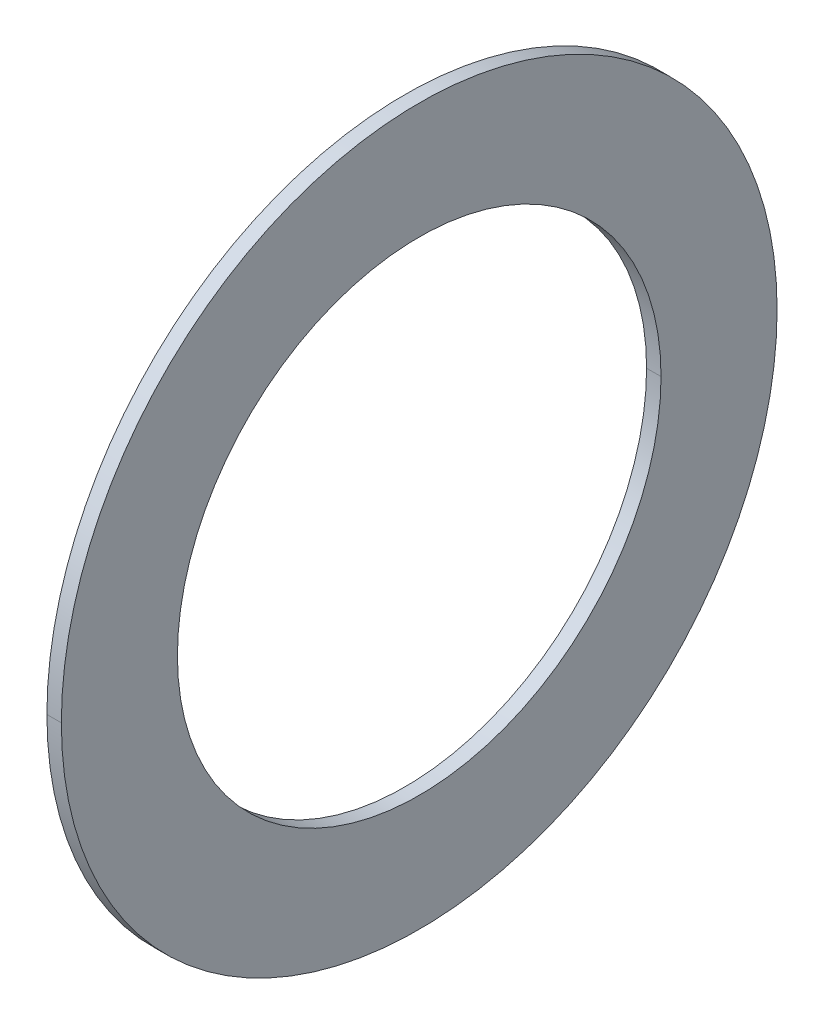
ISO-10303-21;
HEADER;
FILE_DESCRIPTION(('STEP AP214'),'2;1');
FILE_NAME('part.step','',(''),(''),'','','');
FILE_SCHEMA(('AUTOMOTIVE_DESIGN { 1 0 10303 214 1 1 1 1 }'));
ENDSEC;
DATA;
#1=APPLICATION_CONTEXT('core data for automotive mechanical design processes');
#2=APPLICATION_PROTOCOL_DEFINITION('international standard','automotive_design',2000,#1);
#3=PRODUCT_CONTEXT('',#1,'mechanical');
#4=PRODUCT('Part','Part','',(#3));
#5=PRODUCT_RELATED_PRODUCT_CATEGORY('part','',(#4));
#6=PRODUCT_DEFINITION_FORMATION('','',#4);
#7=PRODUCT_DEFINITION_CONTEXT('part definition',#1,'design');
#8=PRODUCT_DEFINITION('design','',#6,#7);
#9=PRODUCT_DEFINITION_SHAPE('','',#8);
#10=(LENGTH_UNIT() NAMED_UNIT(*) SI_UNIT(.MILLI.,.METRE.));
#11=(NAMED_UNIT(*) PLANE_ANGLE_UNIT() SI_UNIT($,.RADIAN.));
#12=(NAMED_UNIT(*) SI_UNIT($,.STERADIAN.) SOLID_ANGLE_UNIT());
#13=UNCERTAINTY_MEASURE_WITH_UNIT(LENGTH_MEASURE(1.E-05),#10,'distance_accuracy_value','');
#14=(GEOMETRIC_REPRESENTATION_CONTEXT(3) GLOBAL_UNCERTAINTY_ASSIGNED_CONTEXT((#13)) GLOBAL_UNIT_ASSIGNED_CONTEXT((#10,
#11,#12)) REPRESENTATION_CONTEXT('',''));
#15=CARTESIAN_POINT('',(0.,0.,0.));
#16=DIRECTION('',(0.,0.,1.));
#17=DIRECTION('',(1.,0.,0.));
#18=AXIS2_PLACEMENT_3D('',#15,#16,#17);
#19=CARTESIAN_POINT('',(0.1992,3.7,0.));
#20=DIRECTION('',(-1.,0.,0.));
#21=DIRECTION('',(0.,0.,1.));
#22=AXIS2_PLACEMENT_3D('',#19,#20,#21);
#23=PLANE('',#22);
#24=CARTESIAN_POINT('',(0.1992,0.,0.));
#25=DIRECTION('',(1.,0.,0.));
#26=DIRECTION('',(0.,0.,-1.));
#27=AXIS2_PLACEMENT_3D('',#24,#25,#26);
#28=CIRCLE('',#27,2.5);
#29=CARTESIAN_POINT('',(0.1992,0.,-2.5));
#30=VERTEX_POINT('',#29);
#31=CARTESIAN_POINT('',(0.1992,0.,2.5));
#32=VERTEX_POINT('',#31);
#33=EDGE_CURVE('E11',#30,#32,#28,.T.);
#34=ORIENTED_EDGE('',*,*,#33,.T.);
#35=CARTESIAN_POINT('',(0.1992,0.,0.));
#36=DIRECTION('',(1.,0.,0.));
#37=DIRECTION('',(0.,0.,-1.));
#38=AXIS2_PLACEMENT_3D('',#35,#36,#37);
#39=CIRCLE('',#38,2.5);
#40=EDGE_CURVE('E25',#32,#30,#39,.T.);
#41=ORIENTED_EDGE('',*,*,#40,.T.);
#42=EDGE_LOOP('',(#34,#41));
#43=FACE_BOUND('',#42,.T.);
#44=CARTESIAN_POINT('',(0.1992,0.,0.));
#45=DIRECTION('',(1.,0.,0.));
#46=DIRECTION('',(0.,0.,-1.));
#47=AXIS2_PLACEMENT_3D('',#44,#45,#46);
#48=CIRCLE('',#47,3.7);
#49=CARTESIAN_POINT('',(0.1992,0.,3.7));
#50=VERTEX_POINT('',#49);
#51=CARTESIAN_POINT('',(0.1992,0.,-3.7));
#52=VERTEX_POINT('',#51);
#53=EDGE_CURVE('E95',#50,#52,#48,.T.);
#54=ORIENTED_EDGE('',*,*,#53,.F.);
#55=CARTESIAN_POINT('',(0.1992,0.,0.));
#56=DIRECTION('',(1.,0.,0.));
#57=DIRECTION('',(0.,0.,-1.));
#58=AXIS2_PLACEMENT_3D('',#55,#56,#57);
#59=CIRCLE('',#58,3.7);
#60=EDGE_CURVE('E90',#52,#50,#59,.T.);
#61=ORIENTED_EDGE('',*,*,#60,.F.);
#62=EDGE_LOOP('',(#54,#61));
#63=FACE_BOUND('',#62,.T.);
#64=ADVANCED_FACE('F17',(#43,#63),#23,.T.);
#65=CARTESIAN_POINT('',(0.3486,0.,0.));
#66=DIRECTION('',(1.,0.,0.));
#67=DIRECTION('',(0.,-1.,0.));
#68=AXIS2_PLACEMENT_3D('',#65,#66,#67);
#69=CYLINDRICAL_SURFACE('',#68,3.7);
#70=DIRECTION('',(1.,0.,0.));
#71=VECTOR('',#70,1.);
#72=CARTESIAN_POINT('',(0.1992,0.,3.7));
#73=LINE('',#72,#71);
#74=CARTESIAN_POINT('',(0.3486,0.,3.7));
#75=VERTEX_POINT('',#74);
#76=EDGE_CURVE('E86',#50,#75,#73,.T.);
#77=ORIENTED_EDGE('',*,*,#76,.T.);
#78=CARTESIAN_POINT('',(0.3486,0.,0.));
#79=DIRECTION('',(1.,0.,0.));
#80=DIRECTION('',(0.,0.,-1.));
#81=AXIS2_PLACEMENT_3D('',#78,#79,#80);
#82=CIRCLE('',#81,3.7);
#83=CARTESIAN_POINT('',(0.3486,0.,-3.7));
#84=VERTEX_POINT('',#83);
#85=EDGE_CURVE('E81',#84,#75,#82,.T.);
#86=ORIENTED_EDGE('',*,*,#85,.F.);
#87=DIRECTION('',(1.,0.,0.));
#88=VECTOR('',#87,1.);
#89=CARTESIAN_POINT('',(0.1992,0.,-3.7));
#90=LINE('',#89,#88);
#91=EDGE_CURVE('E70',#52,#84,#90,.T.);
#92=ORIENTED_EDGE('',*,*,#91,.F.);
#93=ORIENTED_EDGE('',*,*,#60,.T.);
#94=EDGE_LOOP('',(#77,#86,#92,#93));
#95=FACE_BOUND('',#94,.T.);
#96=ADVANCED_FACE('F111',(#95),#69,.T.);
#97=CARTESIAN_POINT('',(0.3486,0.,0.));
#98=DIRECTION('',(1.,0.,0.));
#99=DIRECTION('',(0.,1.,0.));
#100=AXIS2_PLACEMENT_3D('',#97,#98,#99);
#101=CYLINDRICAL_SURFACE('',#100,3.7);
#102=ORIENTED_EDGE('',*,*,#76,.F.);
#103=ORIENTED_EDGE('',*,*,#53,.T.);
#104=ORIENTED_EDGE('',*,*,#91,.T.);
#105=CARTESIAN_POINT('',(0.3486,0.,0.));
#106=DIRECTION('',(1.,0.,0.));
#107=DIRECTION('',(0.,0.,-1.));
#108=AXIS2_PLACEMENT_3D('',#105,#106,#107);
#109=CIRCLE('',#108,3.7);
#110=EDGE_CURVE('E67',#75,#84,#109,.T.);
#111=ORIENTED_EDGE('',*,*,#110,.F.);
#112=EDGE_LOOP('',(#102,#103,#104,#111));
#113=FACE_BOUND('',#112,.T.);
#114=ADVANCED_FACE('F106',(#113),#101,.T.);
#115=CARTESIAN_POINT('',(0.3486,2.5,0.));
#116=DIRECTION('',(1.,0.,0.));
#117=DIRECTION('',(0.,0.,-1.));
#118=AXIS2_PLACEMENT_3D('',#115,#116,#117);
#119=PLANE('',#118);
#120=ORIENTED_EDGE('',*,*,#85,.T.);
#121=ORIENTED_EDGE('',*,*,#110,.T.);
#122=EDGE_LOOP('',(#120,#121));
#123=FACE_BOUND('',#122,.T.);
#124=CARTESIAN_POINT('',(0.3486,0.,0.));
#125=DIRECTION('',(1.,0.,0.));
#126=DIRECTION('',(0.,0.,-1.));
#127=AXIS2_PLACEMENT_3D('',#124,#125,#126);
#128=CIRCLE('',#127,2.5);
#129=CARTESIAN_POINT('',(0.3486,0.,2.5));
#130=VERTEX_POINT('',#129);
#131=CARTESIAN_POINT('',(0.3486,0.,-2.5));
#132=VERTEX_POINT('',#131);
#133=EDGE_CURVE('E55',#130,#132,#128,.T.);
#134=ORIENTED_EDGE('',*,*,#133,.F.);
#135=CARTESIAN_POINT('',(0.3486,0.,0.));
#136=DIRECTION('',(1.,0.,0.));
#137=DIRECTION('',(0.,0.,-1.));
#138=AXIS2_PLACEMENT_3D('',#135,#136,#137);
#139=CIRCLE('',#138,2.5);
#140=EDGE_CURVE('E51',#132,#130,#139,.T.);
#141=ORIENTED_EDGE('',*,*,#140,.F.);
#142=EDGE_LOOP('',(#134,#141));
#143=FACE_BOUND('',#142,.T.);
#144=ADVANCED_FACE('F53',(#123,#143),#119,.T.);
#145=CARTESIAN_POINT('',(0.3486,0.,0.));
#146=DIRECTION('',(1.,0.,0.));
#147=DIRECTION('',(0.,-1.,0.));
#148=AXIS2_PLACEMENT_3D('',#145,#146,#147);
#149=CYLINDRICAL_SURFACE('',#148,2.5);
#150=DIRECTION('',(1.,0.,0.));
#151=VECTOR('',#150,1.);
#152=CARTESIAN_POINT('',(0.1992,0.,2.5));
#153=LINE('',#152,#151);
#154=EDGE_CURVE('E59',#32,#130,#153,.T.);
#155=ORIENTED_EDGE('',*,*,#154,.F.);
#156=ORIENTED_EDGE('',*,*,#33,.F.);
#157=DIRECTION('',(1.,0.,0.));
#158=VECTOR('',#157,1.);
#159=CARTESIAN_POINT('',(0.1992,0.,-2.5));
#160=LINE('',#159,#158);
#161=EDGE_CURVE('E62',#30,#132,#160,.T.);
#162=ORIENTED_EDGE('',*,*,#161,.T.);
#163=ORIENTED_EDGE('',*,*,#140,.T.);
#164=EDGE_LOOP('',(#155,#156,#162,#163));
#165=FACE_BOUND('',#164,.T.);
#166=ADVANCED_FACE('F63',(#165),#149,.F.);
#167=CARTESIAN_POINT('',(0.3486,0.,0.));
#168=DIRECTION('',(1.,0.,0.));
#169=DIRECTION('',(0.,1.,0.));
#170=AXIS2_PLACEMENT_3D('',#167,#168,#169);
#171=CYLINDRICAL_SURFACE('',#170,2.5);
#172=ORIENTED_EDGE('',*,*,#154,.T.);
#173=ORIENTED_EDGE('',*,*,#133,.T.);
#174=ORIENTED_EDGE('',*,*,#161,.F.);
#175=ORIENTED_EDGE('',*,*,#40,.F.);
#176=EDGE_LOOP('',(#172,#173,#174,#175));
#177=FACE_BOUND('',#176,.T.);
#178=ADVANCED_FACE('F66',(#177),#171,.F.);
#179=CLOSED_SHELL('',(#64,#96,#114,#144,#166,#178));
#180=MANIFOLD_SOLID_BREP('B1',#179);
#181=ADVANCED_BREP_SHAPE_REPRESENTATION('',(#18,#180),#14);
#182=SHAPE_DEFINITION_REPRESENTATION(#9,#181);
ENDSEC;
END-ISO-10303-21;
